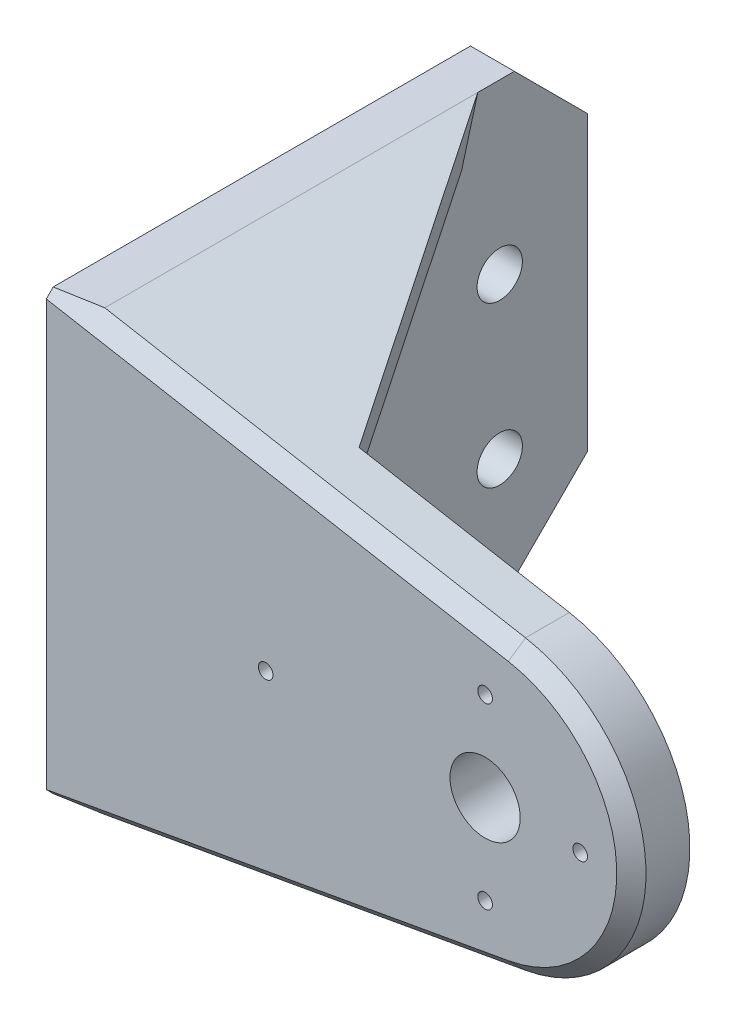
ISO-10303-21;
HEADER;
FILE_DESCRIPTION(('STEP AP214'),'2;1');
FILE_NAME('part.step','',(''),(''),'','','');
FILE_SCHEMA(('AUTOMOTIVE_DESIGN { 1 0 10303 214 1 1 1 1 }'));
ENDSEC;
DATA;
#1=APPLICATION_CONTEXT('core data for automotive mechanical design processes');
#2=APPLICATION_PROTOCOL_DEFINITION('international standard','automotive_design',2000,#1);
#3=PRODUCT_CONTEXT('',#1,'mechanical');
#4=PRODUCT('Part','Part','',(#3));
#5=PRODUCT_RELATED_PRODUCT_CATEGORY('part','',(#4));
#6=PRODUCT_DEFINITION_FORMATION('','',#4);
#7=PRODUCT_DEFINITION_CONTEXT('part definition',#1,'design');
#8=PRODUCT_DEFINITION('design','',#6,#7);
#9=PRODUCT_DEFINITION_SHAPE('','',#8);
#10=(LENGTH_UNIT() NAMED_UNIT(*) SI_UNIT(.MILLI.,.METRE.));
#11=(NAMED_UNIT(*) PLANE_ANGLE_UNIT() SI_UNIT($,.RADIAN.));
#12=(NAMED_UNIT(*) SI_UNIT($,.STERADIAN.) SOLID_ANGLE_UNIT());
#13=UNCERTAINTY_MEASURE_WITH_UNIT(LENGTH_MEASURE(1.E-05),#10,'distance_accuracy_value','');
#14=(GEOMETRIC_REPRESENTATION_CONTEXT(3) GLOBAL_UNCERTAINTY_ASSIGNED_CONTEXT((#13)) GLOBAL_UNIT_ASSIGNED_CONTEXT((#10,
#11,#12)) REPRESENTATION_CONTEXT('',''));
#15=CARTESIAN_POINT('',(0.,0.,0.));
#16=DIRECTION('',(0.,0.,1.));
#17=DIRECTION('',(1.,0.,0.));
#18=AXIS2_PLACEMENT_3D('',#15,#16,#17);
#19=CARTESIAN_POINT('',(0.,0.,0.));
#20=DIRECTION('',(0.,0.,1.));
#21=DIRECTION('',(1.,0.,0.));
#22=AXIS2_PLACEMENT_3D('',#19,#20,#21);
#23=PLANE('',#22);
#24=CARTESIAN_POINT('',(12.056,5.55624999999997,0.));
#25=DIRECTION('',(0.,0.,-1.));
#26=DIRECTION('',(-1.,0.,0.));
#27=AXIS2_PLACEMENT_3D('',#24,#25,#26);
#28=CIRCLE('',#27,0.500000000000001);
#29=CARTESIAN_POINT('',(11.556,5.55624999999997,0.));
#30=VERTEX_POINT('',#29);
#31=EDGE_CURVE('E384',#30,#30,#28,.T.);
#32=ORIENTED_EDGE('',*,*,#31,.F.);
#33=EDGE_LOOP('',(#32));
#34=FACE_BOUND('',#33,.T.);
#35=CARTESIAN_POINT('',(5.55600000000001,-0.543750000000027,0.));
#36=DIRECTION('',(0.,0.,-1.));
#37=DIRECTION('',(-1.,0.,0.));
#38=AXIS2_PLACEMENT_3D('',#35,#36,#37);
#39=CIRCLE('',#38,0.500000000000001);
#40=CARTESIAN_POINT('',(5.05600000000001,-0.543750000000027,0.));
#41=VERTEX_POINT('',#40);
#42=EDGE_CURVE('E378',#41,#41,#39,.T.);
#43=ORIENTED_EDGE('',*,*,#42,.F.);
#44=EDGE_LOOP('',(#43));
#45=FACE_BOUND('',#44,.T.);
#46=CARTESIAN_POINT('',(5.55600000000004,11.65625,0.));
#47=DIRECTION('',(0.,0.,-1.));
#48=DIRECTION('',(-1.,0.,0.));
#49=AXIS2_PLACEMENT_3D('',#46,#47,#48);
#50=CIRCLE('',#49,0.500000000000001);
#51=CARTESIAN_POINT('',(5.05600000000004,11.65625,0.));
#52=VERTEX_POINT('',#51);
#53=EDGE_CURVE('E372',#52,#52,#50,.T.);
#54=ORIENTED_EDGE('',*,*,#53,.F.);
#55=EDGE_LOOP('',(#54));
#56=FACE_BOUND('',#55,.T.);
#57=CARTESIAN_POINT('',(-9.44399999999998,5.55625000000005,0.));
#58=DIRECTION('',(0.,0.,-1.));
#59=DIRECTION('',(-1.,0.,0.));
#60=AXIS2_PLACEMENT_3D('',#57,#58,#59);
#61=CIRCLE('',#60,0.500000000000001);
#62=CARTESIAN_POINT('',(-9.94399999999998,5.55625000000005,0.));
#63=VERTEX_POINT('',#62);
#64=EDGE_CURVE('E366',#63,#63,#61,.T.);
#65=ORIENTED_EDGE('',*,*,#64,.F.);
#66=EDGE_LOOP('',(#65));
#67=FACE_BOUND('',#66,.T.);
#68=CARTESIAN_POINT('',(5.55600000000001,5.55624999999998,0.));
#69=DIRECTION('',(0.,0.,-1.));
#70=DIRECTION('',(-1.,0.,0.));
#71=AXIS2_PLACEMENT_3D('',#68,#69,#70);
#72=CIRCLE('',#71,2.4);
#73=CARTESIAN_POINT('',(3.15600000000001,5.55624999999998,0.));
#74=VERTEX_POINT('',#73);
#75=EDGE_CURVE('E362',#74,#74,#72,.T.);
#76=ORIENTED_EDGE('',*,*,#75,.F.);
#77=EDGE_LOOP('',(#76));
#78=FACE_BOUND('',#77,.T.);
#79=DIRECTION('',(0.984306621168693,0.176466641390014,0.));
#80=VECTOR('',#79,1.);
#81=CARTESIAN_POINT('',(0.972577364263921,-5.42490258613799,0.));
#82=LINE('',#81,#80);
#83=CARTESIAN_POINT('',(-16.444,-8.54734923628022,0.));
#84=VERTEX_POINT('',#83);
#85=CARTESIAN_POINT('',(7.32066641390016,-4.28681621168694,0.));
#86=VERTEX_POINT('',#85);
#87=EDGE_CURVE('E149',#84,#86,#82,.T.);
#88=ORIENTED_EDGE('',*,*,#87,.F.);
#89=DIRECTION('',(0.,1.,0.));
#90=VECTOR('',#89,1.);
#91=CARTESIAN_POINT('',(-16.444,16.4924756496348,0.));
#92=LINE('',#91,#90);
#93=CARTESIAN_POINT('',(-16.444,15.596074885915,0.));
#94=VERTEX_POINT('',#93);
#95=EDGE_CURVE('E181',#84,#94,#92,.T.);
#96=ORIENTED_EDGE('',*,*,#95,.T.);
#97=DIRECTION('',(-0.984306621168693,0.176466641390014,0.));
#98=VECTOR('',#97,1.);
#99=CARTESIAN_POINT('',(2.19692186199313,12.2541275672086,0.));
#100=LINE('',#99,#98);
#101=CARTESIAN_POINT('',(-7.76753335860997,14.0405566211687,0.));
#102=VERTEX_POINT('',#101);
#103=EDGE_CURVE('E247',#102,#94,#100,.T.);
#104=ORIENTED_EDGE('',*,*,#103,.F.);
#105=DIRECTION('',(0.176466641390014,0.984306621168692,0.));
#106=VECTOR('',#105,1.);
#107=CARTESIAN_POINT('',(-7.76753335860997,14.0405566211687,0.));
#108=LINE('',#107,#106);
#109=CARTESIAN_POINT('',(-7.06166679304992,17.9777831058435,0.));
#110=VERTEX_POINT('',#109);
#111=EDGE_CURVE('E243',#102,#110,#108,.T.);
#112=ORIENTED_EDGE('',*,*,#111,.T.);
#113=DIRECTION('',(0.984306621168693,-0.176466641390014,0.));
#114=VECTOR('',#113,1.);
#115=CARTESIAN_POINT('',(2.90278842755319,16.1913540518834,0.));
#116=LINE('',#115,#114);
#117=CARTESIAN_POINT('',(7.32066641390015,15.3993162116869,0.));
#118=VERTEX_POINT('',#117);
#119=EDGE_CURVE('E159',#110,#118,#116,.T.);
#120=ORIENTED_EDGE('',*,*,#119,.T.);
#121=CARTESIAN_POINT('',(5.55600000000001,5.55624999999998,0.));
#122=DIRECTION('',(0.,0.,1.));
#123=DIRECTION('',(1.,0.,0.));
#124=AXIS2_PLACEMENT_3D('',#121,#122,#123);
#125=CIRCLE('',#124,10.);
#126=EDGE_CURVE('E140',#86,#118,#125,.T.);
#127=ORIENTED_EDGE('',*,*,#126,.F.);
#128=EDGE_LOOP('',(#88,#96,#104,#112,#120,#127));
#129=FACE_BOUND('',#128,.T.);
#130=ADVANCED_FACE('F35',(#34,#45,#56,#67,#78,#129),#23,.F.);
#131=CARTESIAN_POINT('',(0.972577364263921,-5.42490258613799,4.));
#132=DIRECTION('',(-0.176466641390014,0.984306621168692,0.));
#133=DIRECTION('',(-0.984306621168693,-0.176466641390014,0.));
#134=AXIS2_PLACEMENT_3D('',#131,#132,#133);
#135=PLANE('',#134);
#136=DIRECTION('',(0.,0.,-1.));
#137=VECTOR('',#136,1.);
#138=CARTESIAN_POINT('',(7.32066641390016,-4.28681621168694,4.));
#139=LINE('',#138,#137);
#140=CARTESIAN_POINT('',(7.32066641390016,-4.28681621168694,3.));
#141=VERTEX_POINT('',#140);
#142=EDGE_CURVE('E136',#141,#86,#139,.T.);
#143=ORIENTED_EDGE('',*,*,#142,.F.);
#144=DIRECTION('',(-0.984306621168693,-0.176466641390014,0.));
#145=VECTOR('',#144,1.);
#146=CARTESIAN_POINT('',(-21.444,-9.44375000000001,3.));
#147=LINE('',#146,#145);
#148=CARTESIAN_POINT('',(-21.444,-9.44375000000001,3.));
#149=VERTEX_POINT('',#148);
#150=EDGE_CURVE('E213',#141,#149,#147,.T.);
#151=ORIENTED_EDGE('',*,*,#150,.T.);
#152=DIRECTION('',(0.,0.,-1.));
#153=VECTOR('',#152,1.);
#154=CARTESIAN_POINT('',(-21.444,-9.44375000000001,4.));
#155=LINE('',#154,#153);
#156=CARTESIAN_POINT('',(-21.444,-9.44375000000001,-5.00000000000004));
#157=VERTEX_POINT('',#156);
#158=EDGE_CURVE('E165',#149,#157,#155,.T.);
#159=ORIENTED_EDGE('',*,*,#158,.T.);
#160=DIRECTION('',(-0.70149251439437,-0.125763685129367,-0.701492514394377));
#161=VECTOR('',#160,1.);
#162=CARTESIAN_POINT('',(-5.62960963975787,-6.6085436806632,10.8143903602422));
#163=LINE('',#162,#161);
#164=EDGE_CURVE('E152',#157,#84,#163,.F.);
#165=ORIENTED_EDGE('',*,*,#164,.T.);
#166=ORIENTED_EDGE('',*,*,#87,.T.);
#167=EDGE_LOOP('',(#143,#151,#159,#165,#166));
#168=FACE_BOUND('',#167,.T.);
#169=ADVANCED_FACE('F150',(#168),#135,.F.);
#170=CARTESIAN_POINT('',(5.55600000000001,5.55624999999998,4.));
#171=DIRECTION('',(0.,0.,-1.));
#172=DIRECTION('',(-1.,0.,0.));
#173=AXIS2_PLACEMENT_3D('',#170,#171,#172);
#174=CYLINDRICAL_SURFACE('',#173,10.);
#175=DIRECTION('',(0.,0.,-1.));
#176=VECTOR('',#175,1.);
#177=CARTESIAN_POINT('',(7.32066641390015,15.3993162116869,4.));
#178=LINE('',#177,#176);
#179=CARTESIAN_POINT('',(7.32066641390015,15.3993162116869,3.));
#180=VERTEX_POINT('',#179);
#181=EDGE_CURVE('E146',#180,#118,#178,.T.);
#182=ORIENTED_EDGE('',*,*,#181,.F.);
#183=CARTESIAN_POINT('',(5.55600000000001,5.55624999999998,3.));
#184=DIRECTION('',(0.,0.,1.));
#185=DIRECTION('',(1.,0.,0.));
#186=AXIS2_PLACEMENT_3D('',#183,#184,#185);
#187=CIRCLE('',#186,10.);
#188=EDGE_CURVE('E142',#180,#141,#187,.F.);
#189=ORIENTED_EDGE('',*,*,#188,.T.);
#190=ORIENTED_EDGE('',*,*,#142,.T.);
#191=ORIENTED_EDGE('',*,*,#126,.T.);
#192=EDGE_LOOP('',(#182,#189,#190,#191));
#193=FACE_BOUND('',#192,.T.);
#194=ADVANCED_FACE('F138',(#193),#174,.T.);
#195=CARTESIAN_POINT('',(2.90278842755319,16.1913540518834,4.));
#196=DIRECTION('',(0.176466641390014,0.984306621168692,0.));
#197=DIRECTION('',(-0.984306621168693,0.176466641390014,0.));
#198=AXIS2_PLACEMENT_3D('',#195,#196,#197);
#199=PLANE('',#198);
#200=DIRECTION('',(0.,0.,-1.));
#201=VECTOR('',#200,1.);
#202=CARTESIAN_POINT('',(-21.444,20.55625,4.));
#203=LINE('',#202,#201);
#204=CARTESIAN_POINT('',(-21.444,20.55625,3.));
#205=VERTEX_POINT('',#204);
#206=CARTESIAN_POINT('',(-21.444,20.55625,-22.5));
#207=VERTEX_POINT('',#206);
#208=EDGE_CURVE('E171',#205,#207,#203,.T.);
#209=ORIENTED_EDGE('',*,*,#208,.F.);
#210=DIRECTION('',(0.984306621168693,-0.176466641390014,0.));
#211=VECTOR('',#210,1.);
#212=CARTESIAN_POINT('',(2.90278842755319,16.1913540518834,3.));
#213=LINE('',#212,#211);
#214=EDGE_CURVE('E44',#205,#180,#213,.T.);
#215=ORIENTED_EDGE('',*,*,#214,.T.);
#216=ORIENTED_EDGE('',*,*,#181,.T.);
#217=ORIENTED_EDGE('',*,*,#119,.F.);
#218=DIRECTION('',(-0.536090991529758,0.0961104748461159,-0.838671106826446));
#219=VECTOR('',#218,1.);
#220=CARTESIAN_POINT('',(-21.444,20.55625,-22.5));
#221=LINE('',#220,#219);
#222=EDGE_CURVE('E229',#110,#207,#221,.T.);
#223=ORIENTED_EDGE('',*,*,#222,.T.);
#224=EDGE_LOOP('',(#209,#215,#216,#217,#223));
#225=FACE_BOUND('',#224,.T.);
#226=ADVANCED_FACE('F311',(#225),#199,.T.);
#227=CARTESIAN_POINT('',(0.,20.55625,4.));
#228=DIRECTION('',(0.,1.,0.));
#229=DIRECTION('',(0.,0.,1.));
#230=AXIS2_PLACEMENT_3D('',#227,#228,#229);
#231=PLANE('',#230);
#232=DIRECTION('',(0.,0.,-1.));
#233=VECTOR('',#232,1.);
#234=CARTESIAN_POINT('',(-24.444,20.55625,4.));
#235=LINE('',#234,#233);
#236=CARTESIAN_POINT('',(-24.444,20.55625,3.52939992417003));
#237=VERTEX_POINT('',#236);
#238=CARTESIAN_POINT('',(-24.444,20.55625,-25.));
#239=VERTEX_POINT('',#238);
#240=EDGE_CURVE('E169',#237,#239,#235,.T.);
#241=ORIENTED_EDGE('',*,*,#240,.F.);
#242=DIRECTION('',(-0.984784223999781,0.,0.173781564503111));
#243=VECTOR('',#242,1.);
#244=CARTESIAN_POINT('',(-0.818746832808342,20.55625,-0.639669154233028));
#245=LINE('',#244,#243);
#246=EDGE_CURVE('E11',#237,#205,#245,.F.);
#247=ORIENTED_EDGE('',*,*,#246,.T.);
#248=ORIENTED_EDGE('',*,*,#208,.T.);
#249=DIRECTION('',(0.,0.,1.));
#250=VECTOR('',#249,1.);
#251=CARTESIAN_POINT('',(-21.444,20.55625,-30.));
#252=LINE('',#251,#250);
#253=CARTESIAN_POINT('',(-21.444,20.55625,-25.));
#254=VERTEX_POINT('',#253);
#255=EDGE_CURVE('E155',#254,#207,#252,.T.);
#256=ORIENTED_EDGE('',*,*,#255,.F.);
#257=DIRECTION('',(-1.,0.,0.));
#258=VECTOR('',#257,1.);
#259=CARTESIAN_POINT('',(0.,20.55625,-25.));
#260=LINE('',#259,#258);
#261=EDGE_CURVE('E203',#254,#239,#260,.T.);
#262=ORIENTED_EDGE('',*,*,#261,.T.);
#263=EDGE_LOOP('',(#241,#247,#248,#256,#262));
#264=FACE_BOUND('',#263,.T.);
#265=ADVANCED_FACE('F282',(#264),#231,.T.);
#266=CARTESIAN_POINT('',(-24.444,0.,4.));
#267=DIRECTION('',(1.,0.,0.));
#268=DIRECTION('',(0.,0.,-1.));
#269=AXIS2_PLACEMENT_3D('',#266,#267,#268);
#270=PLANE('',#269);
#271=CARTESIAN_POINT('',(-24.444,-1.88980237845015,-24.));
#272=DIRECTION('',(1.,0.,0.));
#273=DIRECTION('',(0.,0.,-1.));
#274=AXIS2_PLACEMENT_3D('',#271,#272,#273);
#275=CIRCLE('',#274,1.55);
#276=CARTESIAN_POINT('',(-24.444,-1.88980237845015,-25.55));
#277=VERTEX_POINT('',#276);
#278=EDGE_CURVE('E341',#277,#277,#275,.F.);
#279=ORIENTED_EDGE('',*,*,#278,.F.);
#280=EDGE_LOOP('',(#279));
#281=FACE_BOUND('',#280,.T.);
#282=CARTESIAN_POINT('',(-24.444,-1.88980237845016,-11.));
#283=DIRECTION('',(1.,0.,0.));
#284=DIRECTION('',(0.,0.,-1.));
#285=AXIS2_PLACEMENT_3D('',#282,#283,#284);
#286=CIRCLE('',#285,1.55);
#287=CARTESIAN_POINT('',(-24.444,-1.88980237845016,-12.55));
#288=VERTEX_POINT('',#287);
#289=EDGE_CURVE('E345',#288,#288,#286,.F.);
#290=ORIENTED_EDGE('',*,*,#289,.F.);
#291=EDGE_LOOP('',(#290));
#292=FACE_BOUND('',#291,.T.);
#293=CARTESIAN_POINT('',(-24.444,9.04722097950028,-24.));
#294=DIRECTION('',(1.,0.,0.));
#295=DIRECTION('',(0.,0.,-1.));
#296=AXIS2_PLACEMENT_3D('',#293,#294,#295);
#297=CIRCLE('',#296,1.55);
#298=CARTESIAN_POINT('',(-24.444,9.04722097950028,-25.55));
#299=VERTEX_POINT('',#298);
#300=EDGE_CURVE('E236',#299,#299,#297,.F.);
#301=ORIENTED_EDGE('',*,*,#300,.F.);
#302=EDGE_LOOP('',(#301));
#303=FACE_BOUND('',#302,.T.);
#304=CARTESIAN_POINT('',(-24.444,9.04722097950028,-11.));
#305=DIRECTION('',(1.,0.,0.));
#306=DIRECTION('',(0.,0.,-1.));
#307=AXIS2_PLACEMENT_3D('',#304,#305,#306);
#308=CIRCLE('',#307,1.55);
#309=CARTESIAN_POINT('',(-24.444,9.04722097950028,-12.55));
#310=VERTEX_POINT('',#309);
#311=EDGE_CURVE('E223',#310,#310,#308,.F.);
#312=ORIENTED_EDGE('',*,*,#311,.F.);
#313=EDGE_LOOP('',(#312));
#314=FACE_BOUND('',#313,.T.);
#315=DIRECTION('',(0.,0.,-1.));
#316=VECTOR('',#315,1.);
#317=CARTESIAN_POINT('',(-24.444,-9.44375000000001,4.));
#318=LINE('',#317,#316);
#319=CARTESIAN_POINT('',(-24.444,-9.44375000000001,3.52939992417003));
#320=VERTEX_POINT('',#319);
#321=CARTESIAN_POINT('',(-24.444,-9.44375000000001,-25.));
#322=VERTEX_POINT('',#321);
#323=EDGE_CURVE('E167',#320,#322,#318,.T.);
#324=ORIENTED_EDGE('',*,*,#323,.F.);
#325=DIRECTION('',(0.,0.712676821742271,0.70149251439437));
#326=VECTOR('',#325,1.);
#327=CARTESIAN_POINT('',(-24.444,-6.66733617380483,6.26224243639823));
#328=LINE('',#327,#326);
#329=CARTESIAN_POINT('',(-24.444,-8.96564687064057,4.));
#330=VERTEX_POINT('',#329);
#331=EDGE_CURVE('E219',#320,#330,#328,.T.);
#332=ORIENTED_EDGE('',*,*,#331,.T.);
#333=DIRECTION('',(0.,-1.,0.));
#334=VECTOR('',#333,1.);
#335=CARTESIAN_POINT('',(-24.444,0.,4.));
#336=LINE('',#335,#334);
#337=CARTESIAN_POINT('',(-24.444,20.0781468706405,4.));
#338=VERTEX_POINT('',#337);
#339=EDGE_CURVE('E161',#338,#330,#336,.T.);
#340=ORIENTED_EDGE('',*,*,#339,.F.);
#341=DIRECTION('',(0.,-0.712676821742271,0.70149251439437));
#342=VECTOR('',#341,1.);
#343=CARTESIAN_POINT('',(-24.444,18.6039501788475,5.45106156463686));
#344=LINE('',#343,#342);
#345=EDGE_CURVE('E217',#338,#237,#344,.F.);
#346=ORIENTED_EDGE('',*,*,#345,.T.);
#347=ORIENTED_EDGE('',*,*,#240,.T.);
#348=DIRECTION('',(0.,0.707106781186547,0.707106781186548));
#349=VECTOR('',#348,1.);
#350=CARTESIAN_POINT('',(-24.444,15.55625,-30.));
#351=LINE('',#350,#349);
#352=CARTESIAN_POINT('',(-24.444,15.55625,-30.));
#353=VERTEX_POINT('',#352);
#354=EDGE_CURVE('E192',#239,#353,#351,.F.);
#355=ORIENTED_EDGE('',*,*,#354,.T.);
#356=DIRECTION('',(0.,1.,0.));
#357=VECTOR('',#356,1.);
#358=CARTESIAN_POINT('',(-24.444,-9.44375000000001,-30.));
#359=LINE('',#358,#357);
#360=CARTESIAN_POINT('',(-24.444,-4.44375000000002,-30.));
#361=VERTEX_POINT('',#360);
#362=EDGE_CURVE('E253',#361,#353,#359,.T.);
#363=ORIENTED_EDGE('',*,*,#362,.F.);
#364=DIRECTION('',(0.,-0.707106781186547,0.707106781186548));
#365=VECTOR('',#364,1.);
#366=CARTESIAN_POINT('',(-24.444,-4.44375000000002,-30.));
#367=LINE('',#366,#365);
#368=EDGE_CURVE('E194',#361,#322,#367,.T.);
#369=ORIENTED_EDGE('',*,*,#368,.T.);
#370=EDGE_LOOP('',(#324,#332,#340,#346,#347,#355,#363,#369));
#371=FACE_BOUND('',#370,.T.);
#372=ADVANCED_FACE('F271',(#281,#292,#303,#314,#371),#270,.F.);
#373=CARTESIAN_POINT('',(0.,-9.44375000000001,4.));
#374=DIRECTION('',(0.,1.,0.));
#375=DIRECTION('',(0.,0.,1.));
#376=AXIS2_PLACEMENT_3D('',#373,#374,#375);
#377=PLANE('',#376);
#378=ORIENTED_EDGE('',*,*,#158,.F.);
#379=DIRECTION('',(-0.984784223999781,0.,0.173781564503111));
#380=VECTOR('',#379,1.);
#381=CARTESIAN_POINT('',(-0.0466786793690646,-9.44375000000001,-0.775913428194647));
#382=LINE('',#381,#380);
#383=EDGE_CURVE('E215',#149,#320,#382,.T.);
#384=ORIENTED_EDGE('',*,*,#383,.T.);
#385=ORIENTED_EDGE('',*,*,#323,.T.);
#386=DIRECTION('',(1.,0.,0.));
#387=VECTOR('',#386,1.);
#388=CARTESIAN_POINT('',(-21.444,-9.44375000000001,-25.));
#389=LINE('',#388,#387);
#390=CARTESIAN_POINT('',(-21.444,-9.44375000000001,-25.));
#391=VERTEX_POINT('',#390);
#392=EDGE_CURVE('E197',#322,#391,#389,.T.);
#393=ORIENTED_EDGE('',*,*,#392,.T.);
#394=DIRECTION('',(0.,0.,1.));
#395=VECTOR('',#394,1.);
#396=CARTESIAN_POINT('',(-21.444,-9.44375000000001,-30.));
#397=LINE('',#396,#395);
#398=EDGE_CURVE('E256',#391,#157,#397,.T.);
#399=ORIENTED_EDGE('',*,*,#398,.T.);
#400=EDGE_LOOP('',(#378,#384,#385,#393,#399));
#401=FACE_BOUND('',#400,.T.);
#402=ADVANCED_FACE('F276',(#401),#377,.F.);
#403=CARTESIAN_POINT('',(0.,0.,4.));
#404=DIRECTION('',(0.,0.,1.));
#405=DIRECTION('',(1.,0.,0.));
#406=AXIS2_PLACEMENT_3D('',#403,#404,#405);
#407=PLANE('',#406);
#408=CARTESIAN_POINT('',(12.056,5.55624999999997,4.));
#409=DIRECTION('',(0.,0.,1.));
#410=DIRECTION('',(1.,0.,0.));
#411=AXIS2_PLACEMENT_3D('',#408,#409,#410);
#412=CIRCLE('',#411,0.500000000000001);
#413=CARTESIAN_POINT('',(12.556,5.55624999999997,4.));
#414=VERTEX_POINT('',#413);
#415=EDGE_CURVE('E387',#414,#414,#412,.F.);
#416=ORIENTED_EDGE('',*,*,#415,.T.);
#417=EDGE_LOOP('',(#416));
#418=FACE_BOUND('',#417,.T.);
#419=CARTESIAN_POINT('',(5.55600000000001,-0.543750000000027,4.));
#420=DIRECTION('',(0.,0.,1.));
#421=DIRECTION('',(1.,0.,0.));
#422=AXIS2_PLACEMENT_3D('',#419,#420,#421);
#423=CIRCLE('',#422,0.500000000000001);
#424=CARTESIAN_POINT('',(6.05600000000001,-0.543750000000027,4.));
#425=VERTEX_POINT('',#424);
#426=EDGE_CURVE('E381',#425,#425,#423,.F.);
#427=ORIENTED_EDGE('',*,*,#426,.T.);
#428=EDGE_LOOP('',(#427));
#429=FACE_BOUND('',#428,.T.);
#430=CARTESIAN_POINT('',(5.55600000000004,11.65625,4.));
#431=DIRECTION('',(0.,0.,1.));
#432=DIRECTION('',(1.,0.,0.));
#433=AXIS2_PLACEMENT_3D('',#430,#431,#432);
#434=CIRCLE('',#433,0.500000000000001);
#435=CARTESIAN_POINT('',(6.05600000000004,11.65625,4.));
#436=VERTEX_POINT('',#435);
#437=EDGE_CURVE('E375',#436,#436,#434,.F.);
#438=ORIENTED_EDGE('',*,*,#437,.T.);
#439=EDGE_LOOP('',(#438));
#440=FACE_BOUND('',#439,.T.);
#441=CARTESIAN_POINT('',(-9.44399999999998,5.55625000000005,4.));
#442=DIRECTION('',(0.,0.,1.));
#443=DIRECTION('',(1.,0.,0.));
#444=AXIS2_PLACEMENT_3D('',#441,#442,#443);
#445=CIRCLE('',#444,0.500000000000001);
#446=CARTESIAN_POINT('',(-8.94399999999998,5.55625000000005,4.));
#447=VERTEX_POINT('',#446);
#448=EDGE_CURVE('E369',#447,#447,#445,.F.);
#449=ORIENTED_EDGE('',*,*,#448,.T.);
#450=EDGE_LOOP('',(#449));
#451=FACE_BOUND('',#450,.T.);
#452=CARTESIAN_POINT('',(5.55600000000001,5.55624999999998,4.));
#453=DIRECTION('',(0.,0.,1.));
#454=DIRECTION('',(1.,0.,0.));
#455=AXIS2_PLACEMENT_3D('',#452,#453,#454);
#456=CIRCLE('',#455,2.4);
#457=CARTESIAN_POINT('',(7.95600000000001,5.55624999999998,4.));
#458=VERTEX_POINT('',#457);
#459=EDGE_CURVE('E363',#458,#458,#456,.F.);
#460=ORIENTED_EDGE('',*,*,#459,.T.);
#461=EDGE_LOOP('',(#460));
#462=FACE_BOUND('',#461,.T.);
#463=ORIENTED_EDGE('',*,*,#339,.T.);
#464=DIRECTION('',(0.984306621168693,0.176466641390014,0.));
#465=VECTOR('',#464,1.);
#466=CARTESIAN_POINT('',(7.14419977251014,-3.30250959051824,4.));
#467=LINE('',#466,#465);
#468=CARTESIAN_POINT('',(7.14419977251014,-3.30250959051823,4.));
#469=VERTEX_POINT('',#468);
#470=EDGE_CURVE('E210',#330,#469,#467,.T.);
#471=ORIENTED_EDGE('',*,*,#470,.T.);
#472=CARTESIAN_POINT('',(5.55600000000001,5.55624999999998,4.));
#473=DIRECTION('',(0.,0.,1.));
#474=DIRECTION('',(1.,0.,0.));
#475=AXIS2_PLACEMENT_3D('',#472,#473,#474);
#476=CIRCLE('',#475,8.99999999999999);
#477=CARTESIAN_POINT('',(7.14419977251014,14.4150095905182,4.));
#478=VERTEX_POINT('',#477);
#479=EDGE_CURVE('E208',#469,#478,#476,.T.);
#480=ORIENTED_EDGE('',*,*,#479,.T.);
#481=DIRECTION('',(-0.984306621168693,0.176466641390014,0.));
#482=VECTOR('',#481,1.);
#483=CARTESIAN_POINT('',(2.72632178616317,15.2070474307147,4.));
#484=LINE('',#483,#482);
#485=EDGE_CURVE('E206',#478,#338,#484,.T.);
#486=ORIENTED_EDGE('',*,*,#485,.T.);
#487=EDGE_LOOP('',(#463,#471,#480,#486));
#488=FACE_BOUND('',#487,.T.);
#489=ADVANCED_FACE('F263',(#418,#429,#440,#451,#462,#488),#407,.T.);
#490=CARTESIAN_POINT('',(-21.444,20.55625,-30.));
#491=DIRECTION('',(-1.,0.,0.));
#492=DIRECTION('',(0.,0.,1.));
#493=AXIS2_PLACEMENT_3D('',#490,#491,#492);
#494=PLANE('',#493);
#495=CARTESIAN_POINT('',(-21.444,-1.88980237845015,-24.));
#496=DIRECTION('',(1.,0.,0.));
#497=DIRECTION('',(0.,0.,-1.));
#498=AXIS2_PLACEMENT_3D('',#495,#496,#497);
#499=CIRCLE('',#498,1.55);
#500=CARTESIAN_POINT('',(-21.444,-1.88980237845015,-25.55));
#501=VERTEX_POINT('',#500);
#502=EDGE_CURVE('E359',#501,#501,#499,.T.);
#503=ORIENTED_EDGE('',*,*,#502,.F.);
#504=EDGE_LOOP('',(#503));
#505=FACE_BOUND('',#504,.T.);
#506=CARTESIAN_POINT('',(-21.444,-1.88980237845016,-11.));
#507=DIRECTION('',(1.,0.,0.));
#508=DIRECTION('',(0.,0.,-1.));
#509=AXIS2_PLACEMENT_3D('',#506,#507,#508);
#510=CIRCLE('',#509,1.55);
#511=CARTESIAN_POINT('',(-21.444,-1.88980237845016,-12.55));
#512=VERTEX_POINT('',#511);
#513=EDGE_CURVE('E355',#512,#512,#510,.T.);
#514=ORIENTED_EDGE('',*,*,#513,.F.);
#515=EDGE_LOOP('',(#514));
#516=FACE_BOUND('',#515,.T.);
#517=CARTESIAN_POINT('',(-21.444,9.04722097950028,-24.));
#518=DIRECTION('',(1.,0.,0.));
#519=DIRECTION('',(0.,0.,-1.));
#520=AXIS2_PLACEMENT_3D('',#517,#518,#519);
#521=CIRCLE('',#520,1.55);
#522=CARTESIAN_POINT('',(-21.444,9.04722097950028,-25.55));
#523=VERTEX_POINT('',#522);
#524=EDGE_CURVE('E350',#523,#523,#521,.T.);
#525=ORIENTED_EDGE('',*,*,#524,.F.);
#526=EDGE_LOOP('',(#525));
#527=FACE_BOUND('',#526,.T.);
#528=CARTESIAN_POINT('',(-21.444,9.04722097950028,-11.));
#529=DIRECTION('',(1.,0.,0.));
#530=DIRECTION('',(0.,0.,-1.));
#531=AXIS2_PLACEMENT_3D('',#528,#529,#530);
#532=CIRCLE('',#531,1.55);
#533=CARTESIAN_POINT('',(-21.444,9.04722097950028,-12.55));
#534=VERTEX_POINT('',#533);
#535=EDGE_CURVE('E231',#534,#534,#532,.T.);
#536=ORIENTED_EDGE('',*,*,#535,.F.);
#537=EDGE_LOOP('',(#536));
#538=FACE_BOUND('',#537,.T.);
#539=ORIENTED_EDGE('',*,*,#398,.F.);
#540=DIRECTION('',(0.,0.707106781186547,-0.707106781186548));
#541=VECTOR('',#540,1.);
#542=CARTESIAN_POINT('',(-21.444,-4.44375000000002,-30.));
#543=LINE('',#542,#541);
#544=CARTESIAN_POINT('',(-21.444,-4.44375000000002,-30.));
#545=VERTEX_POINT('',#544);
#546=EDGE_CURVE('E201',#391,#545,#543,.T.);
#547=ORIENTED_EDGE('',*,*,#546,.T.);
#548=DIRECTION('',(0.,-1.,0.));
#549=VECTOR('',#548,1.);
#550=CARTESIAN_POINT('',(-21.444,20.55625,-30.));
#551=LINE('',#550,#549);
#552=CARTESIAN_POINT('',(-21.444,15.55625,-30.));
#553=VERTEX_POINT('',#552);
#554=EDGE_CURVE('E250',#553,#545,#551,.T.);
#555=ORIENTED_EDGE('',*,*,#554,.F.);
#556=DIRECTION('',(0.,-0.707106781186547,-0.707106781186548));
#557=VECTOR('',#556,1.);
#558=CARTESIAN_POINT('',(-21.444,15.55625,-30.));
#559=LINE('',#558,#557);
#560=EDGE_CURVE('E199',#553,#254,#559,.F.);
#561=ORIENTED_EDGE('',*,*,#560,.T.);
#562=ORIENTED_EDGE('',*,*,#255,.T.);
#563=DIRECTION('',(0.,-0.965006385351043,0.262226383553817));
#564=VECTOR('',#563,1.);
#565=CARTESIAN_POINT('',(-21.444,22.4541260090271,-23.0157200717379));
#566=LINE('',#565,#564);
#567=CARTESIAN_POINT('',(-21.444,16.4924756496348,-21.3957287043366));
#568=VERTEX_POINT('',#567);
#569=EDGE_CURVE('E175',#207,#568,#566,.T.);
#570=ORIENTED_EDGE('',*,*,#569,.T.);
#571=DIRECTION('',(0.,0.,-1.));
#572=VECTOR('',#571,1.);
#573=CARTESIAN_POINT('',(-21.444,16.4924756496348,-30.));
#574=LINE('',#573,#572);
#575=CARTESIAN_POINT('',(-21.444,16.4924756496348,-5.00000000000004));
#576=VERTEX_POINT('',#575);
#577=EDGE_CURVE('E145',#576,#568,#574,.T.);
#578=ORIENTED_EDGE('',*,*,#577,.F.);
#579=DIRECTION('',(0.,-1.,0.));
#580=VECTOR('',#579,1.);
#581=CARTESIAN_POINT('',(-21.444,-9.44375000000001,-5.00000000000004));
#582=LINE('',#581,#580);
#583=EDGE_CURVE('E178',#576,#157,#582,.T.);
#584=ORIENTED_EDGE('',*,*,#583,.T.);
#585=EDGE_LOOP('',(#539,#547,#555,#561,#562,#570,#578,#584));
#586=FACE_BOUND('',#585,.T.);
#587=ADVANCED_FACE('F297',(#505,#516,#527,#538,#586),#494,.F.);
#588=CARTESIAN_POINT('',(0.,0.,-30.));
#589=DIRECTION('',(0.,0.,-1.));
#590=DIRECTION('',(-1.,0.,0.));
#591=AXIS2_PLACEMENT_3D('',#588,#589,#590);
#592=PLANE('',#591);
#593=ORIENTED_EDGE('',*,*,#554,.T.);
#594=DIRECTION('',(-1.,0.,0.));
#595=VECTOR('',#594,1.);
#596=CARTESIAN_POINT('',(-24.444,-4.44375000000002,-30.));
#597=LINE('',#596,#595);
#598=EDGE_CURVE('E189',#545,#361,#597,.T.);
#599=ORIENTED_EDGE('',*,*,#598,.T.);
#600=ORIENTED_EDGE('',*,*,#362,.T.);
#601=DIRECTION('',(1.,0.,0.));
#602=VECTOR('',#601,1.);
#603=CARTESIAN_POINT('',(0.,15.55625,-30.));
#604=LINE('',#603,#602);
#605=EDGE_CURVE('E186',#353,#553,#604,.T.);
#606=ORIENTED_EDGE('',*,*,#605,.T.);
#607=EDGE_LOOP('',(#593,#599,#600,#606));
#608=FACE_BOUND('',#607,.T.);
#609=ADVANCED_FACE('F290',(#608),#592,.T.);
#610=CARTESIAN_POINT('',(-22.14986656556,16.6190235153252,-22.5));
#611=DIRECTION('',(0.825509523432146,-0.147997473452509,-0.544638205210124));
#612=DIRECTION('',(-0.550702686943466,0.,-0.834701473937387));
#613=AXIS2_PLACEMENT_3D('',#610,#611,#612);
#614=PLANE('',#613);
#615=ORIENTED_EDGE('',*,*,#569,.F.);
#616=ORIENTED_EDGE('',*,*,#222,.F.);
#617=ORIENTED_EDGE('',*,*,#111,.F.);
#618=DIRECTION('',(-0.536090991529758,0.0961104748461159,-0.838671106826446));
#619=VECTOR('',#618,1.);
#620=CARTESIAN_POINT('',(-22.14986656556,16.6190235153252,-22.5));
#621=LINE('',#620,#619);
#622=EDGE_CURVE('E240',#102,#568,#621,.T.);
#623=ORIENTED_EDGE('',*,*,#622,.T.);
#624=EDGE_LOOP('',(#615,#616,#617,#623));
#625=FACE_BOUND('',#624,.T.);
#626=ADVANCED_FACE('F309',(#625),#614,.T.);
#627=CARTESIAN_POINT('',(2.19692186199313,12.2541275672086,0.));
#628=DIRECTION('',(0.176466641390014,0.984306621168693,0.));
#629=DIRECTION('',(-0.984306621168693,0.176466641390014,0.));
#630=AXIS2_PLACEMENT_3D('',#627,#628,#629);
#631=PLANE('',#630);
#632=ORIENTED_EDGE('',*,*,#103,.T.);
#633=DIRECTION('',(0.70149251439437,-0.125763685129367,0.701492514394377));
#634=VECTOR('',#633,1.);
#635=CARTESIAN_POINT('',(-21.8025154536344,16.5567503549234,-5.35851545363441));
#636=LINE('',#635,#634);
#637=EDGE_CURVE('E183',#94,#576,#636,.F.);
#638=ORIENTED_EDGE('',*,*,#637,.T.);
#639=ORIENTED_EDGE('',*,*,#577,.T.);
#640=ORIENTED_EDGE('',*,*,#622,.F.);
#641=EDGE_LOOP('',(#632,#638,#639,#640));
#642=FACE_BOUND('',#641,.T.);
#643=ADVANCED_FACE('F306',(#642),#631,.F.);
#644=CARTESIAN_POINT('',(-21.444,20.55625,-5.00000000000004));
#645=DIRECTION('',(0.707106781186551,0.,-0.707106781186544));
#646=DIRECTION('',(0.,1.,0.));
#647=AXIS2_PLACEMENT_3D('',#644,#645,#646);
#648=PLANE('',#647);
#649=ORIENTED_EDGE('',*,*,#637,.F.);
#650=ORIENTED_EDGE('',*,*,#95,.F.);
#651=ORIENTED_EDGE('',*,*,#164,.F.);
#652=ORIENTED_EDGE('',*,*,#583,.F.);
#653=EDGE_LOOP('',(#649,#650,#651,#652));
#654=FACE_BOUND('',#653,.T.);
#655=ADVANCED_FACE('F302',(#654),#648,.T.);
#656=CARTESIAN_POINT('',(0.,-4.44375000000002,-30.));
#657=DIRECTION('',(0.,-0.707106781186548,-0.707106781186547));
#658=DIRECTION('',(1.,0.,0.));
#659=AXIS2_PLACEMENT_3D('',#656,#657,#658);
#660=PLANE('',#659);
#661=ORIENTED_EDGE('',*,*,#546,.F.);
#662=ORIENTED_EDGE('',*,*,#392,.F.);
#663=ORIENTED_EDGE('',*,*,#368,.F.);
#664=ORIENTED_EDGE('',*,*,#598,.F.);
#665=EDGE_LOOP('',(#661,#662,#663,#664));
#666=FACE_BOUND('',#665,.T.);
#667=ADVANCED_FACE('F295',(#666),#660,.T.);
#668=CARTESIAN_POINT('',(0.,15.55625,-30.));
#669=DIRECTION('',(0.,-0.707106781186548,0.707106781186547));
#670=DIRECTION('',(1.,0.,0.));
#671=AXIS2_PLACEMENT_3D('',#668,#669,#670);
#672=PLANE('',#671);
#673=ORIENTED_EDGE('',*,*,#354,.F.);
#674=ORIENTED_EDGE('',*,*,#261,.F.);
#675=ORIENTED_EDGE('',*,*,#560,.F.);
#676=ORIENTED_EDGE('',*,*,#605,.F.);
#677=EDGE_LOOP('',(#673,#674,#675,#676));
#678=FACE_BOUND('',#677,.T.);
#679=ADVANCED_FACE('F288',(#678),#672,.F.);
#680=CARTESIAN_POINT('',(2.90278842755319,16.1913540518834,3.));
#681=DIRECTION('',(-0.124780758780093,-0.696009886595197,-0.707106781186551));
#682=DIRECTION('',(0.984306621168693,-0.176466641390014,0.));
#683=AXIS2_PLACEMENT_3D('',#680,#681,#682);
#684=PLANE('',#683);
#685=ORIENTED_EDGE('',*,*,#345,.F.);
#686=ORIENTED_EDGE('',*,*,#485,.F.);
#687=DIRECTION('',(-0.124780758780094,-0.696009886595204,0.707106781186544));
#688=VECTOR('',#687,1.);
#689=CARTESIAN_POINT('',(7.32066641390015,15.3993162116869,3.));
#690=LINE('',#689,#688);
#691=EDGE_CURVE('E39',#180,#478,#690,.T.);
#692=ORIENTED_EDGE('',*,*,#691,.F.);
#693=ORIENTED_EDGE('',*,*,#214,.F.);
#694=ORIENTED_EDGE('',*,*,#246,.F.);
#695=EDGE_LOOP('',(#685,#686,#692,#693,#694));
#696=FACE_BOUND('',#695,.T.);
#697=ADVANCED_FACE('F37',(#696),#684,.F.);
#698=CARTESIAN_POINT('',(5.55600000000001,5.55624999999998,4.));
#699=DIRECTION('',(0.,0.,-1.));
#700=DIRECTION('',(-1.,0.,0.));
#701=AXIS2_PLACEMENT_3D('',#698,#699,#700);
#702=CONICAL_SURFACE('',#701,8.99999999999999,0.785398163397454);
#703=ORIENTED_EDGE('',*,*,#691,.T.);
#704=ORIENTED_EDGE('',*,*,#479,.F.);
#705=DIRECTION('',(-0.124780758780094,0.696009886595205,0.707106781186544));
#706=VECTOR('',#705,1.);
#707=CARTESIAN_POINT('',(7.32066641390016,-4.28681621168694,3.));
#708=LINE('',#707,#706);
#709=EDGE_CURVE('E222',#141,#469,#708,.T.);
#710=ORIENTED_EDGE('',*,*,#709,.F.);
#711=ORIENTED_EDGE('',*,*,#188,.F.);
#712=EDGE_LOOP('',(#703,#704,#710,#711));
#713=FACE_BOUND('',#712,.T.);
#714=ADVANCED_FACE('F279',(#713),#702,.T.);
#715=CARTESIAN_POINT('',(0.796110722873905,-4.44059596496928,4.));
#716=DIRECTION('',(0.124780758780093,-0.696009886595197,0.707106781186551));
#717=DIRECTION('',(-0.984306621168693,-0.176466641390014,0.));
#718=AXIS2_PLACEMENT_3D('',#715,#716,#717);
#719=PLANE('',#718);
#720=ORIENTED_EDGE('',*,*,#383,.F.);
#721=ORIENTED_EDGE('',*,*,#150,.F.);
#722=ORIENTED_EDGE('',*,*,#709,.T.);
#723=ORIENTED_EDGE('',*,*,#470,.F.);
#724=ORIENTED_EDGE('',*,*,#331,.F.);
#725=EDGE_LOOP('',(#720,#721,#722,#723,#724));
#726=FACE_BOUND('',#725,.T.);
#727=ADVANCED_FACE('F269',(#726),#719,.T.);
#728=CARTESIAN_POINT('',(-24.445,9.04722097950028,-11.));
#729=DIRECTION('',(1.,0.,0.));
#730=DIRECTION('',(0.,0.,-1.));
#731=AXIS2_PLACEMENT_3D('',#728,#729,#730);
#732=CYLINDRICAL_SURFACE('',#731,1.55);
#733=ORIENTED_EDGE('',*,*,#535,.T.);
#734=EDGE_LOOP('',(#733));
#735=FACE_BOUND('',#734,.T.);
#736=ORIENTED_EDGE('',*,*,#311,.T.);
#737=EDGE_LOOP('',(#736));
#738=FACE_BOUND('',#737,.T.);
#739=ADVANCED_FACE('F427',(#735,#738),#732,.F.);
#740=CARTESIAN_POINT('',(-24.445,9.04722097950028,-24.));
#741=DIRECTION('',(1.,0.,0.));
#742=DIRECTION('',(0.,0.,-1.));
#743=AXIS2_PLACEMENT_3D('',#740,#741,#742);
#744=CYLINDRICAL_SURFACE('',#743,1.55);
#745=ORIENTED_EDGE('',*,*,#524,.T.);
#746=EDGE_LOOP('',(#745));
#747=FACE_BOUND('',#746,.T.);
#748=ORIENTED_EDGE('',*,*,#300,.T.);
#749=EDGE_LOOP('',(#748));
#750=FACE_BOUND('',#749,.T.);
#751=ADVANCED_FACE('F423',(#747,#750),#744,.F.);
#752=CARTESIAN_POINT('',(-24.445,-1.88980237845016,-11.));
#753=DIRECTION('',(1.,0.,0.));
#754=DIRECTION('',(0.,0.,-1.));
#755=AXIS2_PLACEMENT_3D('',#752,#753,#754);
#756=CYLINDRICAL_SURFACE('',#755,1.55);
#757=ORIENTED_EDGE('',*,*,#513,.T.);
#758=EDGE_LOOP('',(#757));
#759=FACE_BOUND('',#758,.T.);
#760=ORIENTED_EDGE('',*,*,#289,.T.);
#761=EDGE_LOOP('',(#760));
#762=FACE_BOUND('',#761,.T.);
#763=ADVANCED_FACE('F419',(#759,#762),#756,.F.);
#764=CARTESIAN_POINT('',(-24.445,-1.88980237845015,-24.));
#765=DIRECTION('',(1.,0.,0.));
#766=DIRECTION('',(0.,0.,-1.));
#767=AXIS2_PLACEMENT_3D('',#764,#765,#766);
#768=CYLINDRICAL_SURFACE('',#767,1.55);
#769=ORIENTED_EDGE('',*,*,#502,.T.);
#770=EDGE_LOOP('',(#769));
#771=FACE_BOUND('',#770,.T.);
#772=ORIENTED_EDGE('',*,*,#278,.T.);
#773=EDGE_LOOP('',(#772));
#774=FACE_BOUND('',#773,.T.);
#775=ADVANCED_FACE('F415',(#771,#774),#768,.F.);
#776=CARTESIAN_POINT('',(5.55600000000001,5.55624999999998,4.001));
#777=DIRECTION('',(0.,0.,-1.));
#778=DIRECTION('',(-1.,0.,0.));
#779=AXIS2_PLACEMENT_3D('',#776,#777,#778);
#780=CYLINDRICAL_SURFACE('',#779,2.4);
#781=ORIENTED_EDGE('',*,*,#459,.F.);
#782=EDGE_LOOP('',(#781));
#783=FACE_BOUND('',#782,.T.);
#784=ORIENTED_EDGE('',*,*,#75,.T.);
#785=EDGE_LOOP('',(#784));
#786=FACE_BOUND('',#785,.T.);
#787=ADVANCED_FACE('F411',(#783,#786),#780,.F.);
#788=CARTESIAN_POINT('',(-9.44399999999998,5.55625000000005,4.001));
#789=DIRECTION('',(0.,0.,-1.));
#790=DIRECTION('',(-1.,0.,0.));
#791=AXIS2_PLACEMENT_3D('',#788,#789,#790);
#792=CYLINDRICAL_SURFACE('',#791,0.500000000000001);
#793=ORIENTED_EDGE('',*,*,#448,.F.);
#794=EDGE_LOOP('',(#793));
#795=FACE_BOUND('',#794,.T.);
#796=ORIENTED_EDGE('',*,*,#64,.T.);
#797=EDGE_LOOP('',(#796));
#798=FACE_BOUND('',#797,.T.);
#799=ADVANCED_FACE('F407',(#795,#798),#792,.F.);
#800=CARTESIAN_POINT('',(5.55600000000004,11.65625,4.001));
#801=DIRECTION('',(0.,0.,-1.));
#802=DIRECTION('',(-1.,0.,0.));
#803=AXIS2_PLACEMENT_3D('',#800,#801,#802);
#804=CYLINDRICAL_SURFACE('',#803,0.500000000000001);
#805=ORIENTED_EDGE('',*,*,#437,.F.);
#806=EDGE_LOOP('',(#805));
#807=FACE_BOUND('',#806,.T.);
#808=ORIENTED_EDGE('',*,*,#53,.T.);
#809=EDGE_LOOP('',(#808));
#810=FACE_BOUND('',#809,.T.);
#811=ADVANCED_FACE('F400',(#807,#810),#804,.F.);
#812=CARTESIAN_POINT('',(5.55600000000001,-0.543750000000027,4.001));
#813=DIRECTION('',(0.,0.,-1.));
#814=DIRECTION('',(-1.,0.,0.));
#815=AXIS2_PLACEMENT_3D('',#812,#813,#814);
#816=CYLINDRICAL_SURFACE('',#815,0.500000000000001);
#817=ORIENTED_EDGE('',*,*,#426,.F.);
#818=EDGE_LOOP('',(#817));
#819=FACE_BOUND('',#818,.T.);
#820=ORIENTED_EDGE('',*,*,#42,.T.);
#821=EDGE_LOOP('',(#820));
#822=FACE_BOUND('',#821,.T.);
#823=ADVANCED_FACE('F394',(#819,#822),#816,.F.);
#824=CARTESIAN_POINT('',(12.056,5.55624999999997,4.001));
#825=DIRECTION('',(0.,0.,-1.));
#826=DIRECTION('',(-1.,0.,0.));
#827=AXIS2_PLACEMENT_3D('',#824,#825,#826);
#828=CYLINDRICAL_SURFACE('',#827,0.500000000000001);
#829=ORIENTED_EDGE('',*,*,#415,.F.);
#830=EDGE_LOOP('',(#829));
#831=FACE_BOUND('',#830,.T.);
#832=ORIENTED_EDGE('',*,*,#31,.T.);
#833=EDGE_LOOP('',(#832));
#834=FACE_BOUND('',#833,.T.);
#835=ADVANCED_FACE('F392',(#831,#834),#828,.F.);
#836=CLOSED_SHELL('',(#130,#169,#194,#226,#265,#372,#402,#489,#587,#609,#626,#643,#655,#667,
#679,#697,#714,#727,#739,#751,#763,#775,#787,#799,#811,#823,#835));
#837=MANIFOLD_SOLID_BREP('B2',#836);
#838=ADVANCED_BREP_SHAPE_REPRESENTATION('',(#18,#837),#14);
#839=SHAPE_DEFINITION_REPRESENTATION(#9,#838);
ENDSEC;
END-ISO-10303-21;
